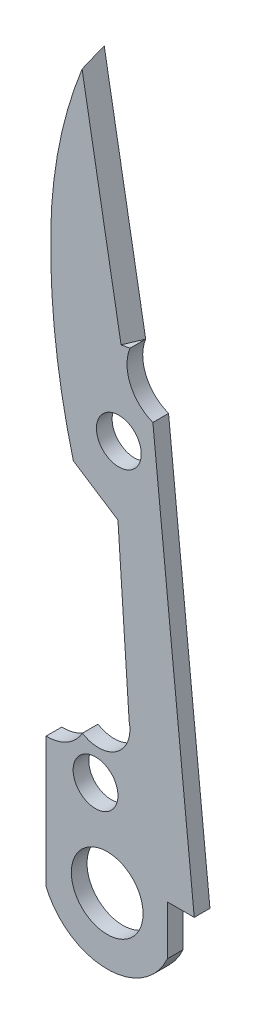
ISO-10303-21;
HEADER;
FILE_DESCRIPTION(('STEP AP214'),'2;1');
FILE_NAME('part.step','',(''),(''),'','','');
FILE_SCHEMA(('AUTOMOTIVE_DESIGN { 1 0 10303 214 1 1 1 1 }'));
ENDSEC;
DATA;
#1=APPLICATION_CONTEXT('core data for automotive mechanical design processes');
#2=APPLICATION_PROTOCOL_DEFINITION('international standard','automotive_design',2000,#1);
#3=PRODUCT_CONTEXT('',#1,'mechanical');
#4=PRODUCT('Part','Part','',(#3));
#5=PRODUCT_RELATED_PRODUCT_CATEGORY('part','',(#4));
#6=PRODUCT_DEFINITION_FORMATION('','',#4);
#7=PRODUCT_DEFINITION_CONTEXT('part definition',#1,'design');
#8=PRODUCT_DEFINITION('design','',#6,#7);
#9=PRODUCT_DEFINITION_SHAPE('','',#8);
#10=(LENGTH_UNIT() NAMED_UNIT(*) SI_UNIT(.MILLI.,.METRE.));
#11=(NAMED_UNIT(*) PLANE_ANGLE_UNIT() SI_UNIT($,.RADIAN.));
#12=(NAMED_UNIT(*) SI_UNIT($,.STERADIAN.) SOLID_ANGLE_UNIT());
#13=UNCERTAINTY_MEASURE_WITH_UNIT(LENGTH_MEASURE(1.E-05),#10,'distance_accuracy_value','');
#14=(GEOMETRIC_REPRESENTATION_CONTEXT(3) GLOBAL_UNCERTAINTY_ASSIGNED_CONTEXT((#13)) GLOBAL_UNIT_ASSIGNED_CONTEXT((#10,
#11,#12)) REPRESENTATION_CONTEXT('',''));
#15=CARTESIAN_POINT('',(0.,0.,0.));
#16=DIRECTION('',(0.,0.,1.));
#17=DIRECTION('',(1.,0.,0.));
#18=AXIS2_PLACEMENT_3D('',#15,#16,#17);
#19=CARTESIAN_POINT('',(76.6296006803347,49.3125007125022,0.889));
#20=DIRECTION('',(0.,0.,-1.));
#21=DIRECTION('',(-1.,0.,0.));
#22=AXIS2_PLACEMENT_3D('',#19,#20,#21);
#23=PLANE('',#22);
#24=CARTESIAN_POINT('',(54.9380006803347,18.8325007125022,0.889));
#25=DIRECTION('',(0.,0.,1.));
#26=DIRECTION('',(1.,0.,0.));
#27=AXIS2_PLACEMENT_3D('',#24,#25,#26);
#28=CIRCLE('',#27,2.032);
#29=CARTESIAN_POINT('',(56.9700006803347,18.8325007125022,0.889));
#30=VERTEX_POINT('',#29);
#31=EDGE_CURVE('E367',#30,#30,#28,.T.);
#32=ORIENTED_EDGE('',*,*,#31,.F.);
#33=EDGE_LOOP('',(#32));
#34=FACE_BOUND('',#33,.T.);
#35=DIRECTION('',(0.984573991795861,0.174968724860083,0.));
#36=VECTOR('',#35,1.);
#37=CARTESIAN_POINT('',(55.724674412599,46.1238954967886,0.889));
#38=LINE('',#37,#36);
#39=CARTESIAN_POINT('',(55.724674412599,46.1238954967886,0.889));
#40=VERTEX_POINT('',#39);
#41=CARTESIAN_POINT('',(56.2300211812281,46.2137007125022,0.889));
#42=VERTEX_POINT('',#41);
#43=EDGE_CURVE('E61',#40,#42,#38,.T.);
#44=ORIENTED_EDGE('',*,*,#43,.F.);
#45=DIRECTION('',(-0.174968724860072,0.984573991795863,0.));
#46=VECTOR('',#45,1.);
#47=CARTESIAN_POINT('',(55.724674412599,46.1238954967886,0.889));
#48=LINE('',#47,#46);
#49=CARTESIAN_POINT('',(53.516020053922,58.5523088612854,0.889));
#50=VERTEX_POINT('',#49);
#51=EDGE_CURVE('E379',#40,#50,#48,.T.);
#52=ORIENTED_EDGE('',*,*,#51,.T.);
#53=CARTESIAN_POINT('',(76.6296006803347,49.3125007125022,0.889));
#54=DIRECTION('',(0.,0.,1.));
#55=DIRECTION('',(-1.,0.,0.));
#56=AXIS2_PLACEMENT_3D('',#53,#54,#55);
#57=CIRCLE('',#56,24.892);
#58=CARTESIAN_POINT('',(51.7414305134214,49.749135276834,0.889));
#59=VERTEX_POINT('',#58);
#60=EDGE_CURVE('E117',#50,#59,#57,.T.);
#61=ORIENTED_EDGE('',*,*,#60,.T.);
#62=CARTESIAN_POINT('',(91.1076006803347,49.0585007125022,0.889));
#63=DIRECTION('',(0.,0.,1.));
#64=DIRECTION('',(1.,0.,0.));
#65=AXIS2_PLACEMENT_3D('',#62,#63,#64);
#66=CIRCLE('',#65,39.3722278987591);
#67=CARTESIAN_POINT('',(53.0195847862257,39.0847664588779,0.889));
#68=VERTEX_POINT('',#67);
#69=EDGE_CURVE('E304',#59,#68,#66,.T.);
#70=ORIENTED_EDGE('',*,*,#69,.T.);
#71=DIRECTION('',(0.837262795216365,-0.546800705693106,0.));
#72=VECTOR('',#71,1.);
#73=CARTESIAN_POINT('',(53.0195847862257,39.0847664588779,0.889));
#74=LINE('',#73,#72);
#75=CARTESIAN_POINT('',(55.5476006803347,37.4337664588779,0.889));
#76=VERTEX_POINT('',#75);
#77=EDGE_CURVE('E252',#68,#76,#74,.T.);
#78=ORIENTED_EDGE('',*,*,#77,.T.);
#79=DIRECTION('',(0.0663428779530117,-0.997796884413312,0.));
#80=VECTOR('',#79,1.);
#81=CARTESIAN_POINT('',(55.5476006803347,37.4337664588779,0.889));
#82=LINE('',#81,#80);
#83=CARTESIAN_POINT('',(56.1826006803347,27.8833664588779,0.889));
#84=VERTEX_POINT('',#83);
#85=EDGE_CURVE('E273',#76,#84,#82,.T.);
#86=ORIENTED_EDGE('',*,*,#85,.T.);
#87=CARTESIAN_POINT('',(54.4477806803347,27.4939007125022,0.889));
#88=DIRECTION('',(0.,0.,-1.));
#89=DIRECTION('',(-1.,0.,0.));
#90=AXIS2_PLACEMENT_3D('',#87,#88,#89);
#91=CIRCLE('',#90,1.778);
#92=CARTESIAN_POINT('',(53.5294376722037,25.971425714541,0.889));
#93=VERTEX_POINT('',#92);
#94=EDGE_CURVE('E269',#84,#93,#91,.T.);
#95=ORIENTED_EDGE('',*,*,#94,.T.);
#96=CARTESIAN_POINT('',(51.5344006803347,27.0875007125022,0.889));
#97=DIRECTION('',(0.,0.,-1.));
#98=DIRECTION('',(-1.,0.,0.));
#99=AXIS2_PLACEMENT_3D('',#96,#97,#98);
#100=CIRCLE('',#99,2.286);
#101=CARTESIAN_POINT('',(51.4750823292987,24.8022704542502,0.889));
#102=VERTEX_POINT('',#101);
#103=EDGE_CURVE('E272',#93,#102,#100,.T.);
#104=ORIENTED_EDGE('',*,*,#103,.T.);
#105=DIRECTION('',(0.,-1.,0.));
#106=VECTOR('',#105,1.);
#107=CARTESIAN_POINT('',(51.4750823292987,24.8022704542502,0.889));
#108=LINE('',#107,#106);
#109=CARTESIAN_POINT('',(51.4750823292987,17.4362704542502,0.889));
#110=VERTEX_POINT('',#109);
#111=EDGE_CURVE('E279',#102,#110,#108,.T.);
#112=ORIENTED_EDGE('',*,*,#111,.T.);
#113=CARTESIAN_POINT('',(54.9380006803347,18.8325007125022,0.889));
#114=DIRECTION('',(0.,0.,1.));
#115=DIRECTION('',(1.,0.,0.));
#116=AXIS2_PLACEMENT_3D('',#113,#114,#115);
#117=CIRCLE('',#116,3.73380000000001);
#118=CARTESIAN_POINT('',(58.3466201134777,17.3085007125022,0.889));
#119=VERTEX_POINT('',#118);
#120=EDGE_CURVE('E286',#110,#119,#117,.T.);
#121=ORIENTED_EDGE('',*,*,#120,.T.);
#122=DIRECTION('',(0.,1.,0.));
#123=VECTOR('',#122,1.);
#124=CARTESIAN_POINT('',(58.3466201134777,20.1025007125022,0.889));
#125=LINE('',#124,#123);
#126=CARTESIAN_POINT('',(58.3466201134777,20.1025007125022,0.889));
#127=VERTEX_POINT('',#126);
#128=EDGE_CURVE('E150',#119,#127,#125,.T.);
#129=ORIENTED_EDGE('',*,*,#128,.T.);
#130=DIRECTION('',(1.,0.,0.));
#131=VECTOR('',#130,1.);
#132=CARTESIAN_POINT('',(59.8706201134777,20.1025007125022,0.889));
#133=LINE('',#132,#131);
#134=CARTESIAN_POINT('',(59.8706201134777,20.1025007125022,0.889));
#135=VERTEX_POINT('',#134);
#136=EDGE_CURVE('E145',#127,#135,#133,.T.);
#137=ORIENTED_EDGE('',*,*,#136,.T.);
#138=DIRECTION('',(-0.100922718343669,0.994894268212519,0.));
#139=VECTOR('',#138,1.);
#140=CARTESIAN_POINT('',(57.5259209968704,43.2165007125022,0.889));
#141=LINE('',#140,#139);
#142=CARTESIAN_POINT('',(57.5259209968704,43.2165007125022,0.889));
#143=VERTEX_POINT('',#142);
#144=EDGE_CURVE('E148',#135,#143,#141,.T.);
#145=ORIENTED_EDGE('',*,*,#144,.T.);
#146=CARTESIAN_POINT('',(58.3466201134777,45.3501007125022,0.889));
#147=DIRECTION('',(0.,0.,-1.));
#148=DIRECTION('',(1.,0.,0.));
#149=AXIS2_PLACEMENT_3D('',#146,#147,#148);
#150=CIRCLE('',#149,2.286);
#151=EDGE_CURVE('E163',#143,#42,#150,.T.);
#152=ORIENTED_EDGE('',*,*,#151,.T.);
#153=EDGE_LOOP('',(#44,#52,#61,#70,#78,#86,#95,#104,#112,#121,#129,#137,#145,#152));
#154=FACE_BOUND('',#153,.T.);
#155=CARTESIAN_POINT('',(54.2776006803347,23.9125007125022,0.889));
#156=DIRECTION('',(0.,0.,1.));
#157=DIRECTION('',(1.,0.,0.));
#158=AXIS2_PLACEMENT_3D('',#155,#156,#157);
#159=CIRCLE('',#158,1.27);
#160=CARTESIAN_POINT('',(55.5476006803347,23.9125007125022,0.889));
#161=VERTEX_POINT('',#160);
#162=EDGE_CURVE('E177',#161,#161,#159,.T.);
#163=ORIENTED_EDGE('',*,*,#162,.F.);
#164=EDGE_LOOP('',(#163));
#165=FACE_BOUND('',#164,.T.);
#166=CARTESIAN_POINT('',(55.5984006803347,41.3369007125022,0.889));
#167=DIRECTION('',(0.,0.,1.));
#168=DIRECTION('',(1.,0.,0.));
#169=AXIS2_PLACEMENT_3D('',#166,#167,#168);
#170=CIRCLE('',#169,1.27);
#171=CARTESIAN_POINT('',(56.8684006803347,41.3369007125022,0.889));
#172=VERTEX_POINT('',#171);
#173=EDGE_CURVE('E349',#172,#172,#170,.T.);
#174=ORIENTED_EDGE('',*,*,#173,.F.);
#175=EDGE_LOOP('',(#174));
#176=FACE_BOUND('',#175,.T.);
#177=ADVANCED_FACE('F43',(#34,#154,#165,#176),#23,.F.);
#178=CARTESIAN_POINT('',(76.6296006803347,49.3125007125022,0.));
#179=DIRECTION('',(0.,0.,-1.));
#180=DIRECTION('',(-1.,0.,0.));
#181=AXIS2_PLACEMENT_3D('',#178,#179,#180);
#182=PLANE('',#181);
#183=CARTESIAN_POINT('',(54.9380006803347,18.8325007125022,0.));
#184=DIRECTION('',(0.,0.,1.));
#185=DIRECTION('',(1.,0.,0.));
#186=AXIS2_PLACEMENT_3D('',#183,#184,#185);
#187=CIRCLE('',#186,2.032);
#188=CARTESIAN_POINT('',(56.9700006803347,18.8325007125022,0.));
#189=VERTEX_POINT('',#188);
#190=EDGE_CURVE('E361',#189,#189,#187,.T.);
#191=ORIENTED_EDGE('',*,*,#190,.T.);
#192=EDGE_LOOP('',(#191));
#193=FACE_BOUND('',#192,.T.);
#194=CARTESIAN_POINT('',(54.2776006803347,23.9125007125022,0.));
#195=DIRECTION('',(0.,0.,1.));
#196=DIRECTION('',(1.,0.,0.));
#197=AXIS2_PLACEMENT_3D('',#194,#195,#196);
#198=CIRCLE('',#197,1.27);
#199=CARTESIAN_POINT('',(55.5476006803347,23.9125007125022,0.));
#200=VERTEX_POINT('',#199);
#201=EDGE_CURVE('E343',#200,#200,#198,.T.);
#202=ORIENTED_EDGE('',*,*,#201,.T.);
#203=EDGE_LOOP('',(#202));
#204=FACE_BOUND('',#203,.T.);
#205=CARTESIAN_POINT('',(76.6296006803347,49.3125007125022,0.));
#206=DIRECTION('',(0.,0.,1.));
#207=DIRECTION('',(-1.,0.,0.));
#208=AXIS2_PLACEMENT_3D('',#205,#206,#207);
#209=CIRCLE('',#208,24.892);
#210=CARTESIAN_POINT('',(53.8828264175958,59.4217007125022,0.));
#211=VERTEX_POINT('',#210);
#212=CARTESIAN_POINT('',(51.7414305134214,49.749135276834,0.));
#213=VERTEX_POINT('',#212);
#214=EDGE_CURVE('E172',#211,#213,#209,.T.);
#215=ORIENTED_EDGE('',*,*,#214,.F.);
#216=DIRECTION('',(-0.174968724860072,0.984573991795863,0.));
#217=VECTOR('',#216,1.);
#218=CARTESIAN_POINT('',(53.8828264175958,59.4217007125022,0.));
#219=LINE('',#218,#217);
#220=CARTESIAN_POINT('',(56.2300211812281,46.2137007125022,0.));
#221=VERTEX_POINT('',#220);
#222=EDGE_CURVE('E209',#221,#211,#219,.T.);
#223=ORIENTED_EDGE('',*,*,#222,.F.);
#224=CARTESIAN_POINT('',(58.3466201134777,45.3501007125022,0.));
#225=DIRECTION('',(0.,0.,-1.));
#226=DIRECTION('',(1.,0.,0.));
#227=AXIS2_PLACEMENT_3D('',#224,#225,#226);
#228=CIRCLE('',#227,2.286);
#229=CARTESIAN_POINT('',(57.5259209968704,43.2165007125022,0.));
#230=VERTEX_POINT('',#229);
#231=EDGE_CURVE('E205',#230,#221,#228,.T.);
#232=ORIENTED_EDGE('',*,*,#231,.F.);
#233=DIRECTION('',(-0.100922718343669,0.994894268212519,0.));
#234=VECTOR('',#233,1.);
#235=CARTESIAN_POINT('',(57.5259209968704,43.2165007125022,0.));
#236=LINE('',#235,#234);
#237=CARTESIAN_POINT('',(59.8706201134777,20.1025007125022,0.));
#238=VERTEX_POINT('',#237);
#239=EDGE_CURVE('E108',#238,#230,#236,.T.);
#240=ORIENTED_EDGE('',*,*,#239,.F.);
#241=DIRECTION('',(1.,0.,0.));
#242=VECTOR('',#241,1.);
#243=CARTESIAN_POINT('',(59.8706201134777,20.1025007125022,0.));
#244=LINE('',#243,#242);
#245=CARTESIAN_POINT('',(58.3466201134777,20.1025007125022,0.));
#246=VERTEX_POINT('',#245);
#247=EDGE_CURVE('E101',#246,#238,#244,.T.);
#248=ORIENTED_EDGE('',*,*,#247,.F.);
#249=DIRECTION('',(0.,1.,0.));
#250=VECTOR('',#249,1.);
#251=CARTESIAN_POINT('',(58.3466201134777,20.1025007125022,0.));
#252=LINE('',#251,#250);
#253=CARTESIAN_POINT('',(58.3466201134777,17.3085007125022,0.));
#254=VERTEX_POINT('',#253);
#255=EDGE_CURVE('E198',#254,#246,#252,.T.);
#256=ORIENTED_EDGE('',*,*,#255,.F.);
#257=CARTESIAN_POINT('',(54.9380006803347,18.8325007125022,0.));
#258=DIRECTION('',(0.,0.,1.));
#259=DIRECTION('',(1.,0.,0.));
#260=AXIS2_PLACEMENT_3D('',#257,#258,#259);
#261=CIRCLE('',#260,3.73380000000001);
#262=CARTESIAN_POINT('',(51.4750823292987,17.4362704542502,0.));
#263=VERTEX_POINT('',#262);
#264=EDGE_CURVE('E195',#263,#254,#261,.T.);
#265=ORIENTED_EDGE('',*,*,#264,.F.);
#266=DIRECTION('',(0.,-1.,0.));
#267=VECTOR('',#266,1.);
#268=CARTESIAN_POINT('',(51.4750823292987,24.8022704542502,0.));
#269=LINE('',#268,#267);
#270=CARTESIAN_POINT('',(51.4750823292987,24.8022704542502,0.));
#271=VERTEX_POINT('',#270);
#272=EDGE_CURVE('E192',#271,#263,#269,.T.);
#273=ORIENTED_EDGE('',*,*,#272,.F.);
#274=CARTESIAN_POINT('',(51.5344006803347,27.0875007125022,0.));
#275=DIRECTION('',(0.,0.,-1.));
#276=DIRECTION('',(-1.,0.,0.));
#277=AXIS2_PLACEMENT_3D('',#274,#275,#276);
#278=CIRCLE('',#277,2.286);
#279=CARTESIAN_POINT('',(53.5294376722037,25.971425714541,0.));
#280=VERTEX_POINT('',#279);
#281=EDGE_CURVE('E189',#280,#271,#278,.T.);
#282=ORIENTED_EDGE('',*,*,#281,.F.);
#283=CARTESIAN_POINT('',(54.4477806803347,27.4939007125022,0.));
#284=DIRECTION('',(0.,0.,-1.));
#285=DIRECTION('',(-1.,0.,0.));
#286=AXIS2_PLACEMENT_3D('',#283,#284,#285);
#287=CIRCLE('',#286,1.778);
#288=CARTESIAN_POINT('',(56.1826006803347,27.8833664588779,0.));
#289=VERTEX_POINT('',#288);
#290=EDGE_CURVE('E186',#289,#280,#287,.T.);
#291=ORIENTED_EDGE('',*,*,#290,.F.);
#292=DIRECTION('',(0.0663428779530117,-0.997796884413312,0.));
#293=VECTOR('',#292,1.);
#294=CARTESIAN_POINT('',(55.5476006803347,37.4337664588779,0.));
#295=LINE('',#294,#293);
#296=CARTESIAN_POINT('',(55.5476006803347,37.4337664588779,0.));
#297=VERTEX_POINT('',#296);
#298=EDGE_CURVE('E183',#297,#289,#295,.T.);
#299=ORIENTED_EDGE('',*,*,#298,.F.);
#300=DIRECTION('',(0.837262795216365,-0.546800705693106,0.));
#301=VECTOR('',#300,1.);
#302=CARTESIAN_POINT('',(53.0195847862257,39.0847664588779,0.));
#303=LINE('',#302,#301);
#304=CARTESIAN_POINT('',(53.0195847862257,39.0847664588779,0.));
#305=VERTEX_POINT('',#304);
#306=EDGE_CURVE('E180',#305,#297,#303,.T.);
#307=ORIENTED_EDGE('',*,*,#306,.F.);
#308=CARTESIAN_POINT('',(91.1076006803347,49.0585007125022,0.));
#309=DIRECTION('',(0.,0.,1.));
#310=DIRECTION('',(1.,0.,0.));
#311=AXIS2_PLACEMENT_3D('',#308,#309,#310);
#312=CIRCLE('',#311,39.3722278987591);
#313=EDGE_CURVE('E176',#213,#305,#312,.T.);
#314=ORIENTED_EDGE('',*,*,#313,.F.);
#315=EDGE_LOOP('',(#215,#223,#232,#240,#248,#256,#265,#273,#282,#291,#299,#307,#314));
#316=FACE_BOUND('',#315,.T.);
#317=CARTESIAN_POINT('',(55.5984006803347,41.3369007125022,0.));
#318=DIRECTION('',(0.,0.,1.));
#319=DIRECTION('',(1.,0.,0.));
#320=AXIS2_PLACEMENT_3D('',#317,#318,#319);
#321=CIRCLE('',#320,1.27);
#322=CARTESIAN_POINT('',(56.8684006803347,41.3369007125022,0.));
#323=VERTEX_POINT('',#322);
#324=EDGE_CURVE('E355',#323,#323,#321,.T.);
#325=ORIENTED_EDGE('',*,*,#324,.T.);
#326=EDGE_LOOP('',(#325));
#327=FACE_BOUND('',#326,.T.);
#328=ADVANCED_FACE('F257',(#193,#204,#316,#327),#182,.T.);
#329=CARTESIAN_POINT('',(76.6296006803347,49.3125007125022,0.889));
#330=DIRECTION('',(0.,0.,-1.));
#331=DIRECTION('',(-1.,0.,0.));
#332=AXIS2_PLACEMENT_3D('',#329,#330,#331);
#333=CYLINDRICAL_SURFACE('',#332,24.892);
#334=ORIENTED_EDGE('',*,*,#60,.F.);
#335=CARTESIAN_POINT('',(76.6296006803347,49.3125007125022,-35.7271652993972));
#336=DIRECTION('',(-0.852666088800674,-0.151527360596593,-0.499999999999992));
#337=DIRECTION('',(0.492286995897924,0.0874843624300345,-0.866025403784443));
#338=AXIS2_PLACEMENT_3D('',#335,#336,#337);
#339=ELLIPSE('',#338,49.7840000000008,24.892);
#340=EDGE_CURVE('E373',#50,#211,#339,.T.);
#341=ORIENTED_EDGE('',*,*,#340,.T.);
#342=ORIENTED_EDGE('',*,*,#214,.T.);
#343=DIRECTION('',(0.,0.,-1.));
#344=VECTOR('',#343,1.);
#345=CARTESIAN_POINT('',(51.7414305134214,49.749135276834,0.889));
#346=LINE('',#345,#344);
#347=EDGE_CURVE('E11',#59,#213,#346,.T.);
#348=ORIENTED_EDGE('',*,*,#347,.F.);
#349=EDGE_LOOP('',(#334,#341,#342,#348));
#350=FACE_BOUND('',#349,.T.);
#351=ADVANCED_FACE('F45',(#350),#333,.T.);
#352=CARTESIAN_POINT('',(91.1076006803347,49.0585007125022,0.889));
#353=DIRECTION('',(0.,0.,-1.));
#354=DIRECTION('',(-1.,0.,0.));
#355=AXIS2_PLACEMENT_3D('',#352,#353,#354);
#356=CYLINDRICAL_SURFACE('',#355,39.3722278987591);
#357=ORIENTED_EDGE('',*,*,#313,.T.);
#358=DIRECTION('',(0.,0.,-1.));
#359=VECTOR('',#358,1.);
#360=CARTESIAN_POINT('',(53.0195847862257,39.0847664588779,0.889));
#361=LINE('',#360,#359);
#362=EDGE_CURVE('E53',#68,#305,#361,.T.);
#363=ORIENTED_EDGE('',*,*,#362,.F.);
#364=ORIENTED_EDGE('',*,*,#69,.F.);
#365=ORIENTED_EDGE('',*,*,#347,.T.);
#366=EDGE_LOOP('',(#357,#363,#364,#365));
#367=FACE_BOUND('',#366,.T.);
#368=ADVANCED_FACE('F412',(#367),#356,.T.);
#369=CARTESIAN_POINT('',(53.0195847862257,39.0847664588779,0.889));
#370=DIRECTION('',(0.546800705693106,0.837262795216365,0.));
#371=DIRECTION('',(-0.837262795216365,0.546800705693106,0.));
#372=AXIS2_PLACEMENT_3D('',#369,#370,#371);
#373=PLANE('',#372);
#374=ORIENTED_EDGE('',*,*,#306,.T.);
#375=DIRECTION('',(0.,0.,-1.));
#376=VECTOR('',#375,1.);
#377=CARTESIAN_POINT('',(55.5476006803347,37.4337664588779,0.889));
#378=LINE('',#377,#376);
#379=EDGE_CURVE('E239',#76,#297,#378,.T.);
#380=ORIENTED_EDGE('',*,*,#379,.F.);
#381=ORIENTED_EDGE('',*,*,#77,.F.);
#382=ORIENTED_EDGE('',*,*,#362,.T.);
#383=EDGE_LOOP('',(#374,#380,#381,#382));
#384=FACE_BOUND('',#383,.T.);
#385=ADVANCED_FACE('F250',(#384),#373,.F.);
#386=CARTESIAN_POINT('',(55.5476006803347,37.4337664588779,0.889));
#387=DIRECTION('',(0.997796884413312,0.0663428779530117,0.));
#388=DIRECTION('',(-0.0663428779530117,0.997796884413312,0.));
#389=AXIS2_PLACEMENT_3D('',#386,#387,#388);
#390=PLANE('',#389);
#391=ORIENTED_EDGE('',*,*,#298,.T.);
#392=DIRECTION('',(0.,0.,-1.));
#393=VECTOR('',#392,1.);
#394=CARTESIAN_POINT('',(56.1826006803347,27.8833664588779,0.889));
#395=LINE('',#394,#393);
#396=EDGE_CURVE('E235',#84,#289,#395,.T.);
#397=ORIENTED_EDGE('',*,*,#396,.F.);
#398=ORIENTED_EDGE('',*,*,#85,.F.);
#399=ORIENTED_EDGE('',*,*,#379,.T.);
#400=EDGE_LOOP('',(#391,#397,#398,#399));
#401=FACE_BOUND('',#400,.T.);
#402=ADVANCED_FACE('F263',(#401),#390,.F.);
#403=CARTESIAN_POINT('',(54.4477806803347,27.4939007125022,0.889));
#404=DIRECTION('',(0.,0.,-1.));
#405=DIRECTION('',(-1.,0.,0.));
#406=AXIS2_PLACEMENT_3D('',#403,#404,#405);
#407=CYLINDRICAL_SURFACE('',#406,1.778);
#408=ORIENTED_EDGE('',*,*,#290,.T.);
#409=DIRECTION('',(0.,0.,-1.));
#410=VECTOR('',#409,1.);
#411=CARTESIAN_POINT('',(53.5294376722037,25.971425714541,0.889));
#412=LINE('',#411,#410);
#413=EDGE_CURVE('E231',#93,#280,#412,.T.);
#414=ORIENTED_EDGE('',*,*,#413,.F.);
#415=ORIENTED_EDGE('',*,*,#94,.F.);
#416=ORIENTED_EDGE('',*,*,#396,.T.);
#417=EDGE_LOOP('',(#408,#414,#415,#416));
#418=FACE_BOUND('',#417,.T.);
#419=ADVANCED_FACE('F267',(#418),#407,.F.);
#420=CARTESIAN_POINT('',(51.5344006803347,27.0875007125022,0.889));
#421=DIRECTION('',(0.,0.,-1.));
#422=DIRECTION('',(-1.,0.,0.));
#423=AXIS2_PLACEMENT_3D('',#420,#421,#422);
#424=CYLINDRICAL_SURFACE('',#423,2.286);
#425=ORIENTED_EDGE('',*,*,#281,.T.);
#426=DIRECTION('',(0.,0.,-1.));
#427=VECTOR('',#426,1.);
#428=CARTESIAN_POINT('',(51.4750823292987,24.8022704542502,0.889));
#429=LINE('',#428,#427);
#430=EDGE_CURVE('E227',#102,#271,#429,.T.);
#431=ORIENTED_EDGE('',*,*,#430,.F.);
#432=ORIENTED_EDGE('',*,*,#103,.F.);
#433=ORIENTED_EDGE('',*,*,#413,.T.);
#434=EDGE_LOOP('',(#425,#431,#432,#433));
#435=FACE_BOUND('',#434,.T.);
#436=ADVANCED_FACE('F449',(#435),#424,.F.);
#437=CARTESIAN_POINT('',(51.4750823292987,24.8022704542502,0.889));
#438=DIRECTION('',(1.,0.,0.));
#439=DIRECTION('',(0.,0.,-1.));
#440=AXIS2_PLACEMENT_3D('',#437,#438,#439);
#441=PLANE('',#440);
#442=ORIENTED_EDGE('',*,*,#272,.T.);
#443=DIRECTION('',(0.,0.,-1.));
#444=VECTOR('',#443,1.);
#445=CARTESIAN_POINT('',(51.4750823292987,17.4362704542502,0.889));
#446=LINE('',#445,#444);
#447=EDGE_CURVE('E223',#110,#263,#446,.T.);
#448=ORIENTED_EDGE('',*,*,#447,.F.);
#449=ORIENTED_EDGE('',*,*,#111,.F.);
#450=ORIENTED_EDGE('',*,*,#430,.T.);
#451=EDGE_LOOP('',(#442,#448,#449,#450));
#452=FACE_BOUND('',#451,.T.);
#453=ADVANCED_FACE('F445',(#452),#441,.F.);
#454=CARTESIAN_POINT('',(54.9380006803347,18.8325007125022,0.889));
#455=DIRECTION('',(0.,0.,-1.));
#456=DIRECTION('',(-1.,0.,0.));
#457=AXIS2_PLACEMENT_3D('',#454,#455,#456);
#458=CYLINDRICAL_SURFACE('',#457,3.73380000000001);
#459=ORIENTED_EDGE('',*,*,#264,.T.);
#460=DIRECTION('',(0.,0.,-1.));
#461=VECTOR('',#460,1.);
#462=CARTESIAN_POINT('',(58.3466201134777,17.3085007125022,0.889));
#463=LINE('',#462,#461);
#464=EDGE_CURVE('E219',#119,#254,#463,.T.);
#465=ORIENTED_EDGE('',*,*,#464,.F.);
#466=ORIENTED_EDGE('',*,*,#120,.F.);
#467=ORIENTED_EDGE('',*,*,#447,.T.);
#468=EDGE_LOOP('',(#459,#465,#466,#467));
#469=FACE_BOUND('',#468,.T.);
#470=ADVANCED_FACE('F441',(#469),#458,.T.);
#471=CARTESIAN_POINT('',(58.3466201134777,20.1025007125022,0.889));
#472=DIRECTION('',(-1.,0.,0.));
#473=DIRECTION('',(0.,0.,1.));
#474=AXIS2_PLACEMENT_3D('',#471,#472,#473);
#475=PLANE('',#474);
#476=ORIENTED_EDGE('',*,*,#255,.T.);
#477=DIRECTION('',(0.,0.,-1.));
#478=VECTOR('',#477,1.);
#479=CARTESIAN_POINT('',(58.3466201134777,20.1025007125022,0.889));
#480=LINE('',#479,#478);
#481=EDGE_CURVE('E157',#127,#246,#480,.T.);
#482=ORIENTED_EDGE('',*,*,#481,.F.);
#483=ORIENTED_EDGE('',*,*,#128,.F.);
#484=ORIENTED_EDGE('',*,*,#464,.T.);
#485=EDGE_LOOP('',(#476,#482,#483,#484));
#486=FACE_BOUND('',#485,.T.);
#487=ADVANCED_FACE('F438',(#486),#475,.F.);
#488=CARTESIAN_POINT('',(59.8706201134777,20.1025007125022,0.889));
#489=DIRECTION('',(0.,1.,0.));
#490=DIRECTION('',(-1.,0.,0.));
#491=AXIS2_PLACEMENT_3D('',#488,#489,#490);
#492=PLANE('',#491);
#493=ORIENTED_EDGE('',*,*,#247,.T.);
#494=DIRECTION('',(0.,0.,-1.));
#495=VECTOR('',#494,1.);
#496=CARTESIAN_POINT('',(59.8706201134777,20.1025007125022,0.889));
#497=LINE('',#496,#495);
#498=EDGE_CURVE('E154',#135,#238,#497,.T.);
#499=ORIENTED_EDGE('',*,*,#498,.F.);
#500=ORIENTED_EDGE('',*,*,#136,.F.);
#501=ORIENTED_EDGE('',*,*,#481,.T.);
#502=EDGE_LOOP('',(#493,#499,#500,#501));
#503=FACE_BOUND('',#502,.T.);
#504=ADVANCED_FACE('F155',(#503),#492,.F.);
#505=CARTESIAN_POINT('',(57.5259209968704,43.2165007125022,0.889));
#506=DIRECTION('',(-0.99489426821252,-0.100922718343669,0.));
#507=DIRECTION('',(0.100922718343669,-0.99489426821252,0.));
#508=AXIS2_PLACEMENT_3D('',#505,#506,#507);
#509=PLANE('',#508);
#510=ORIENTED_EDGE('',*,*,#239,.T.);
#511=DIRECTION('',(0.,0.,-1.));
#512=VECTOR('',#511,1.);
#513=CARTESIAN_POINT('',(57.5259209968704,43.2165007125022,0.889));
#514=LINE('',#513,#512);
#515=EDGE_CURVE('E158',#143,#230,#514,.T.);
#516=ORIENTED_EDGE('',*,*,#515,.F.);
#517=ORIENTED_EDGE('',*,*,#144,.F.);
#518=ORIENTED_EDGE('',*,*,#498,.T.);
#519=EDGE_LOOP('',(#510,#516,#517,#518));
#520=FACE_BOUND('',#519,.T.);
#521=ADVANCED_FACE('F160',(#520),#509,.F.);
#522=CARTESIAN_POINT('',(58.3466201134777,45.3501007125022,0.889));
#523=DIRECTION('',(0.,0.,-1.));
#524=DIRECTION('',(-1.,0.,0.));
#525=AXIS2_PLACEMENT_3D('',#522,#523,#524);
#526=CYLINDRICAL_SURFACE('',#525,2.286);
#527=ORIENTED_EDGE('',*,*,#231,.T.);
#528=DIRECTION('',(0.,0.,-1.));
#529=VECTOR('',#528,1.);
#530=CARTESIAN_POINT('',(56.2300211812281,46.2137007125022,0.889));
#531=LINE('',#530,#529);
#532=EDGE_CURVE('E168',#42,#221,#531,.T.);
#533=ORIENTED_EDGE('',*,*,#532,.F.);
#534=ORIENTED_EDGE('',*,*,#151,.F.);
#535=ORIENTED_EDGE('',*,*,#515,.T.);
#536=EDGE_LOOP('',(#527,#533,#534,#535));
#537=FACE_BOUND('',#536,.T.);
#538=ADVANCED_FACE('F404',(#537),#526,.F.);
#539=CARTESIAN_POINT('',(54.2776006803347,23.9125007125022,0.889));
#540=DIRECTION('',(0.,0.,-1.));
#541=DIRECTION('',(-1.,0.,0.));
#542=AXIS2_PLACEMENT_3D('',#539,#540,#541);
#543=CYLINDRICAL_SURFACE('',#542,1.27);
#544=ORIENTED_EDGE('',*,*,#162,.T.);
#545=EDGE_LOOP('',(#544));
#546=FACE_BOUND('',#545,.T.);
#547=ORIENTED_EDGE('',*,*,#201,.F.);
#548=EDGE_LOOP('',(#547));
#549=FACE_BOUND('',#548,.T.);
#550=ADVANCED_FACE('F429',(#546,#549),#543,.F.);
#551=CARTESIAN_POINT('',(55.5984006803347,41.3369007125022,0.889));
#552=DIRECTION('',(0.,0.,-1.));
#553=DIRECTION('',(-1.,0.,0.));
#554=AXIS2_PLACEMENT_3D('',#551,#552,#553);
#555=CYLINDRICAL_SURFACE('',#554,1.27);
#556=ORIENTED_EDGE('',*,*,#173,.T.);
#557=EDGE_LOOP('',(#556));
#558=FACE_BOUND('',#557,.T.);
#559=ORIENTED_EDGE('',*,*,#324,.F.);
#560=EDGE_LOOP('',(#559));
#561=FACE_BOUND('',#560,.T.);
#562=ADVANCED_FACE('F499',(#558,#561),#555,.F.);
#563=CARTESIAN_POINT('',(54.9380006803347,18.8325007125022,0.));
#564=DIRECTION('',(0.,0.,1.));
#565=DIRECTION('',(1.,0.,0.));
#566=AXIS2_PLACEMENT_3D('',#563,#564,#565);
#567=CYLINDRICAL_SURFACE('',#566,2.032);
#568=ORIENTED_EDGE('',*,*,#190,.F.);
#569=EDGE_LOOP('',(#568));
#570=FACE_BOUND('',#569,.T.);
#571=ORIENTED_EDGE('',*,*,#31,.T.);
#572=EDGE_LOOP('',(#571));
#573=FACE_BOUND('',#572,.T.);
#574=ADVANCED_FACE('F506',(#570,#573),#567,.F.);
#575=CARTESIAN_POINT('',(55.724674412599,46.1238954967886,0.889));
#576=DIRECTION('',(-0.852666088800674,-0.151527360596593,-0.499999999999992));
#577=DIRECTION('',(-0.505840912836132,0.,0.862626785406707));
#578=AXIS2_PLACEMENT_3D('',#575,#576,#577);
#579=PLANE('',#578);
#580=ORIENTED_EDGE('',*,*,#51,.F.);
#581=DIRECTION('',(-0.492286995897923,-0.0874843624300403,0.866025403784443));
#582=VECTOR('',#581,1.);
#583=CARTESIAN_POINT('',(55.724674412599,46.1238954967886,0.889));
#584=LINE('',#583,#582);
#585=EDGE_CURVE('E384',#221,#40,#584,.T.);
#586=ORIENTED_EDGE('',*,*,#585,.F.);
#587=ORIENTED_EDGE('',*,*,#222,.T.);
#588=ORIENTED_EDGE('',*,*,#340,.F.);
#589=EDGE_LOOP('',(#580,#586,#587,#588));
#590=FACE_BOUND('',#589,.T.);
#591=ADVANCED_FACE('F409',(#590),#579,.F.);
#592=CARTESIAN_POINT('',(-6.23978937539712,35.1121855532333,0.));
#593=DIRECTION('',(0.174968724860083,-0.984573991795861,0.));
#594=DIRECTION('',(0.984573991795861,0.174968724860083,0.));
#595=AXIS2_PLACEMENT_3D('',#592,#593,#594);
#596=PLANE('',#595);
#597=ORIENTED_EDGE('',*,*,#43,.T.);
#598=ORIENTED_EDGE('',*,*,#532,.T.);
#599=ORIENTED_EDGE('',*,*,#585,.T.);
#600=EDGE_LOOP('',(#597,#598,#599));
#601=FACE_BOUND('',#600,.T.);
#602=ADVANCED_FACE('F396',(#601),#596,.F.);
#603=CLOSED_SHELL('',(#177,#328,#351,#368,#385,#402,#419,#436,#453,#470,#487,#504,#521,#538,
#550,#562,#574,#591,#602));
#604=MANIFOLD_SOLID_BREP('B2',#603);
#605=ADVANCED_BREP_SHAPE_REPRESENTATION('',(#18,#604),#14);
#606=SHAPE_DEFINITION_REPRESENTATION(#9,#605);
ENDSEC;
END-ISO-10303-21;
